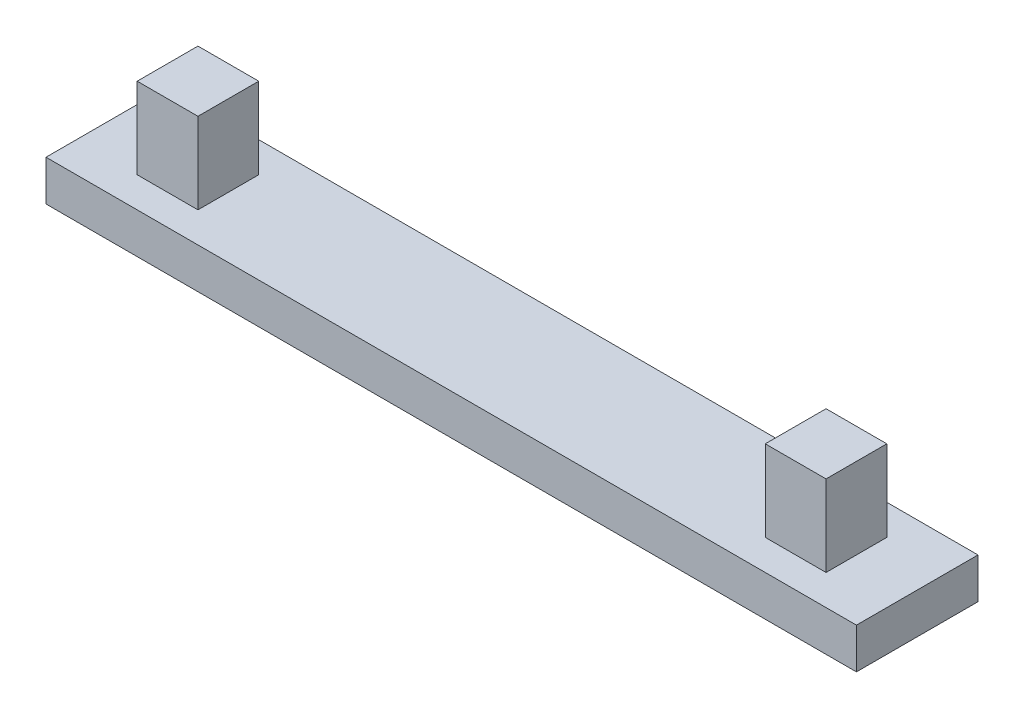
ISO-10303-21;
HEADER;
FILE_DESCRIPTION(('STEP AP214'),'2;1');
FILE_NAME('part.step','',(''),(''),'','','');
FILE_SCHEMA(('AUTOMOTIVE_DESIGN { 1 0 10303 214 1 1 1 1 }'));
ENDSEC;
DATA;
#1=APPLICATION_CONTEXT('core data for automotive mechanical design processes');
#2=APPLICATION_PROTOCOL_DEFINITION('international standard','automotive_design',2000,#1);
#3=PRODUCT_CONTEXT('',#1,'mechanical');
#4=PRODUCT('Part','Part','',(#3));
#5=PRODUCT_RELATED_PRODUCT_CATEGORY('part','',(#4));
#6=PRODUCT_DEFINITION_FORMATION('','',#4);
#7=PRODUCT_DEFINITION_CONTEXT('part definition',#1,'design');
#8=PRODUCT_DEFINITION('design','',#6,#7);
#9=PRODUCT_DEFINITION_SHAPE('','',#8);
#10=(LENGTH_UNIT() NAMED_UNIT(*) SI_UNIT(.MILLI.,.METRE.));
#11=(NAMED_UNIT(*) PLANE_ANGLE_UNIT() SI_UNIT($,.RADIAN.));
#12=(NAMED_UNIT(*) SI_UNIT($,.STERADIAN.) SOLID_ANGLE_UNIT());
#13=UNCERTAINTY_MEASURE_WITH_UNIT(LENGTH_MEASURE(1.E-05),#10,'distance_accuracy_value','');
#14=(GEOMETRIC_REPRESENTATION_CONTEXT(3) GLOBAL_UNCERTAINTY_ASSIGNED_CONTEXT((#13)) GLOBAL_UNIT_ASSIGNED_CONTEXT((#10,
#11,#12)) REPRESENTATION_CONTEXT('',''));
#15=CARTESIAN_POINT('',(0.,0.,0.));
#16=DIRECTION('',(0.,0.,1.));
#17=DIRECTION('',(1.,0.,0.));
#18=AXIS2_PLACEMENT_3D('',#15,#16,#17);
#19=CARTESIAN_POINT('',(0.,1.,0.));
#20=DIRECTION('',(0.,0.,-1.));
#21=DIRECTION('',(-1.,0.,0.));
#22=AXIS2_PLACEMENT_3D('',#19,#20,#21);
#23=PLANE('',#22);
#24=DIRECTION('',(1.,0.,0.));
#25=VECTOR('',#24,1.);
#26=CARTESIAN_POINT('',(0.,0.,0.));
#27=LINE('',#26,#25);
#28=CARTESIAN_POINT('',(0.,0.,0.));
#29=VERTEX_POINT('',#28);
#30=CARTESIAN_POINT('',(20.,0.,0.));
#31=VERTEX_POINT('',#30);
#32=EDGE_CURVE('E136',#29,#31,#27,.T.);
#33=ORIENTED_EDGE('',*,*,#32,.T.);
#34=DIRECTION('',(0.,-1.,0.));
#35=VECTOR('',#34,1.);
#36=CARTESIAN_POINT('',(20.,1.,0.));
#37=LINE('',#36,#35);
#38=CARTESIAN_POINT('',(20.,1.,0.));
#39=VERTEX_POINT('',#38);
#40=EDGE_CURVE('E11',#39,#31,#37,.T.);
#41=ORIENTED_EDGE('',*,*,#40,.F.);
#42=DIRECTION('',(1.,0.,0.));
#43=VECTOR('',#42,1.);
#44=CARTESIAN_POINT('',(0.,1.,0.));
#45=LINE('',#44,#43);
#46=CARTESIAN_POINT('',(0.,1.,0.));
#47=VERTEX_POINT('',#46);
#48=EDGE_CURVE('E101',#47,#39,#45,.T.);
#49=ORIENTED_EDGE('',*,*,#48,.F.);
#50=DIRECTION('',(0.,-1.,0.));
#51=VECTOR('',#50,1.);
#52=CARTESIAN_POINT('',(0.,1.,0.));
#53=LINE('',#52,#51);
#54=EDGE_CURVE('E78',#47,#29,#53,.T.);
#55=ORIENTED_EDGE('',*,*,#54,.T.);
#56=EDGE_LOOP('',(#33,#41,#49,#55));
#57=FACE_BOUND('',#56,.T.);
#58=ADVANCED_FACE('F35',(#57),#23,.F.);
#59=CARTESIAN_POINT('',(20.,1.,0.));
#60=DIRECTION('',(-1.,0.,0.));
#61=DIRECTION('',(0.,0.,1.));
#62=AXIS2_PLACEMENT_3D('',#59,#60,#61);
#63=PLANE('',#62);
#64=DIRECTION('',(0.,0.,-1.));
#65=VECTOR('',#64,1.);
#66=CARTESIAN_POINT('',(20.,0.,0.));
#67=LINE('',#66,#65);
#68=CARTESIAN_POINT('',(20.,0.,-3.));
#69=VERTEX_POINT('',#68);
#70=EDGE_CURVE('E138',#31,#69,#67,.T.);
#71=ORIENTED_EDGE('',*,*,#70,.T.);
#72=DIRECTION('',(0.,-1.,0.));
#73=VECTOR('',#72,1.);
#74=CARTESIAN_POINT('',(20.,1.,-3.));
#75=LINE('',#74,#73);
#76=CARTESIAN_POINT('',(20.,1.,-3.));
#77=VERTEX_POINT('',#76);
#78=EDGE_CURVE('E43',#77,#69,#75,.T.);
#79=ORIENTED_EDGE('',*,*,#78,.F.);
#80=DIRECTION('',(0.,0.,-1.));
#81=VECTOR('',#80,1.);
#82=CARTESIAN_POINT('',(20.,1.,0.));
#83=LINE('',#82,#81);
#84=EDGE_CURVE('E86',#39,#77,#83,.T.);
#85=ORIENTED_EDGE('',*,*,#84,.F.);
#86=ORIENTED_EDGE('',*,*,#40,.T.);
#87=EDGE_LOOP('',(#71,#79,#85,#86));
#88=FACE_BOUND('',#87,.T.);
#89=ADVANCED_FACE('F148',(#88),#63,.F.);
#90=CARTESIAN_POINT('',(0.,1.,-3.));
#91=DIRECTION('',(0.,0.,-1.));
#92=DIRECTION('',(-1.,0.,0.));
#93=AXIS2_PLACEMENT_3D('',#90,#91,#92);
#94=PLANE('',#93);
#95=DIRECTION('',(1.,0.,0.));
#96=VECTOR('',#95,1.);
#97=CARTESIAN_POINT('',(0.,0.,-3.));
#98=LINE('',#97,#96);
#99=CARTESIAN_POINT('',(0.,0.,-3.));
#100=VERTEX_POINT('',#99);
#101=EDGE_CURVE('E142',#100,#69,#98,.T.);
#102=ORIENTED_EDGE('',*,*,#101,.F.);
#103=DIRECTION('',(0.,-1.,0.));
#104=VECTOR('',#103,1.);
#105=CARTESIAN_POINT('',(0.,1.,-3.));
#106=LINE('',#105,#104);
#107=CARTESIAN_POINT('',(0.,1.,-3.));
#108=VERTEX_POINT('',#107);
#109=EDGE_CURVE('E70',#108,#100,#106,.T.);
#110=ORIENTED_EDGE('',*,*,#109,.F.);
#111=DIRECTION('',(1.,0.,0.));
#112=VECTOR('',#111,1.);
#113=CARTESIAN_POINT('',(0.,1.,-3.));
#114=LINE('',#113,#112);
#115=EDGE_CURVE('E108',#108,#77,#114,.T.);
#116=ORIENTED_EDGE('',*,*,#115,.T.);
#117=ORIENTED_EDGE('',*,*,#78,.T.);
#118=EDGE_LOOP('',(#102,#110,#116,#117));
#119=FACE_BOUND('',#118,.T.);
#120=ADVANCED_FACE('F147',(#119),#94,.T.);
#121=CARTESIAN_POINT('',(0.,1.,0.));
#122=DIRECTION('',(-1.,0.,0.));
#123=DIRECTION('',(0.,0.,1.));
#124=AXIS2_PLACEMENT_3D('',#121,#122,#123);
#125=PLANE('',#124);
#126=DIRECTION('',(0.,0.,-1.));
#127=VECTOR('',#126,1.);
#128=CARTESIAN_POINT('',(0.,0.,0.));
#129=LINE('',#128,#127);
#130=EDGE_CURVE('E97',#29,#100,#129,.T.);
#131=ORIENTED_EDGE('',*,*,#130,.F.);
#132=ORIENTED_EDGE('',*,*,#54,.F.);
#133=DIRECTION('',(0.,0.,-1.));
#134=VECTOR('',#133,1.);
#135=CARTESIAN_POINT('',(0.,1.,0.));
#136=LINE('',#135,#134);
#137=EDGE_CURVE('E95',#47,#108,#136,.T.);
#138=ORIENTED_EDGE('',*,*,#137,.T.);
#139=ORIENTED_EDGE('',*,*,#109,.T.);
#140=EDGE_LOOP('',(#131,#132,#138,#139));
#141=FACE_BOUND('',#140,.T.);
#142=ADVANCED_FACE('F93',(#141),#125,.T.);
#143=CARTESIAN_POINT('',(0.,1.,0.));
#144=DIRECTION('',(0.,1.,0.));
#145=DIRECTION('',(0.,0.,1.));
#146=AXIS2_PLACEMENT_3D('',#143,#144,#145);
#147=PLANE('',#146);
#148=ORIENTED_EDGE('',*,*,#48,.T.);
#149=ORIENTED_EDGE('',*,*,#84,.T.);
#150=ORIENTED_EDGE('',*,*,#115,.F.);
#151=ORIENTED_EDGE('',*,*,#137,.F.);
#152=EDGE_LOOP('',(#148,#149,#150,#151));
#153=FACE_BOUND('',#152,.T.);
#154=DIRECTION('',(1.,0.,0.));
#155=VECTOR('',#154,1.);
#156=CARTESIAN_POINT('',(0.,1.,-2.25));
#157=LINE('',#156,#155);
#158=CARTESIAN_POINT('',(1.5,1.,-2.25));
#159=VERTEX_POINT('',#158);
#160=CARTESIAN_POINT('',(3.,1.,-2.25));
#161=VERTEX_POINT('',#160);
#162=EDGE_CURVE('E109',#159,#161,#157,.T.);
#163=ORIENTED_EDGE('',*,*,#162,.T.);
#164=DIRECTION('',(0.,0.,1.));
#165=VECTOR('',#164,1.);
#166=CARTESIAN_POINT('',(3.,1.,0.));
#167=LINE('',#166,#165);
#168=CARTESIAN_POINT('',(3.,1.,-0.75));
#169=VERTEX_POINT('',#168);
#170=EDGE_CURVE('E112',#161,#169,#167,.T.);
#171=ORIENTED_EDGE('',*,*,#170,.T.);
#172=DIRECTION('',(1.,0.,0.));
#173=VECTOR('',#172,1.);
#174=CARTESIAN_POINT('',(0.,1.,-0.75));
#175=LINE('',#174,#173);
#176=CARTESIAN_POINT('',(1.5,1.,-0.75));
#177=VERTEX_POINT('',#176);
#178=EDGE_CURVE('E119',#177,#169,#175,.T.);
#179=ORIENTED_EDGE('',*,*,#178,.F.);
#180=DIRECTION('',(0.,0.,1.));
#181=VECTOR('',#180,1.);
#182=CARTESIAN_POINT('',(1.5,1.,0.));
#183=LINE('',#182,#181);
#184=EDGE_CURVE('E122',#159,#177,#183,.T.);
#185=ORIENTED_EDGE('',*,*,#184,.F.);
#186=EDGE_LOOP('',(#163,#171,#179,#185));
#187=FACE_BOUND('',#186,.T.);
#188=DIRECTION('',(1.,0.,0.));
#189=VECTOR('',#188,1.);
#190=CARTESIAN_POINT('',(0.,1.,-2.25));
#191=LINE('',#190,#189);
#192=CARTESIAN_POINT('',(17.,1.,-2.25));
#193=VERTEX_POINT('',#192);
#194=CARTESIAN_POINT('',(18.5,1.,-2.25));
#195=VERTEX_POINT('',#194);
#196=EDGE_CURVE('E125',#193,#195,#191,.T.);
#197=ORIENTED_EDGE('',*,*,#196,.T.);
#198=DIRECTION('',(0.,0.,1.));
#199=VECTOR('',#198,1.);
#200=CARTESIAN_POINT('',(18.5,1.,0.));
#201=LINE('',#200,#199);
#202=CARTESIAN_POINT('',(18.5,1.,-0.75));
#203=VERTEX_POINT('',#202);
#204=EDGE_CURVE('E128',#195,#203,#201,.T.);
#205=ORIENTED_EDGE('',*,*,#204,.T.);
#206=DIRECTION('',(1.,0.,0.));
#207=VECTOR('',#206,1.);
#208=CARTESIAN_POINT('',(0.,1.,-0.75));
#209=LINE('',#208,#207);
#210=CARTESIAN_POINT('',(17.,1.,-0.75));
#211=VERTEX_POINT('',#210);
#212=EDGE_CURVE('E131',#211,#203,#209,.T.);
#213=ORIENTED_EDGE('',*,*,#212,.F.);
#214=DIRECTION('',(0.,0.,1.));
#215=VECTOR('',#214,1.);
#216=CARTESIAN_POINT('',(17.,1.,0.));
#217=LINE('',#216,#215);
#218=EDGE_CURVE('E98',#193,#211,#217,.T.);
#219=ORIENTED_EDGE('',*,*,#218,.F.);
#220=EDGE_LOOP('',(#197,#205,#213,#219));
#221=FACE_BOUND('',#220,.T.);
#222=ADVANCED_FACE('F105',(#153,#187,#221),#147,.T.);
#223=CARTESIAN_POINT('',(0.,0.,0.));
#224=DIRECTION('',(0.,1.,0.));
#225=DIRECTION('',(0.,0.,1.));
#226=AXIS2_PLACEMENT_3D('',#223,#224,#225);
#227=PLANE('',#226);
#228=ORIENTED_EDGE('',*,*,#32,.F.);
#229=ORIENTED_EDGE('',*,*,#130,.T.);
#230=ORIENTED_EDGE('',*,*,#101,.T.);
#231=ORIENTED_EDGE('',*,*,#70,.F.);
#232=EDGE_LOOP('',(#228,#229,#230,#231));
#233=FACE_BOUND('',#232,.T.);
#234=ADVANCED_FACE('F150',(#233),#227,.F.);
#235=CARTESIAN_POINT('',(1.5,3.,-2.25));
#236=DIRECTION('',(1.,0.,0.));
#237=DIRECTION('',(0.,0.,-1.));
#238=AXIS2_PLACEMENT_3D('',#235,#236,#237);
#239=PLANE('',#238);
#240=ORIENTED_EDGE('',*,*,#184,.T.);
#241=DIRECTION('',(0.,-1.,0.));
#242=VECTOR('',#241,1.);
#243=CARTESIAN_POINT('',(1.5,3.,-0.75));
#244=LINE('',#243,#242);
#245=CARTESIAN_POINT('',(1.5,3.,-0.75));
#246=VERTEX_POINT('',#245);
#247=EDGE_CURVE('E139',#246,#177,#244,.T.);
#248=ORIENTED_EDGE('',*,*,#247,.F.);
#249=DIRECTION('',(0.,0.,1.));
#250=VECTOR('',#249,1.);
#251=CARTESIAN_POINT('',(1.5,3.,-2.25));
#252=LINE('',#251,#250);
#253=CARTESIAN_POINT('',(1.5,3.,-2.25));
#254=VERTEX_POINT('',#253);
#255=EDGE_CURVE('E301',#254,#246,#252,.T.);
#256=ORIENTED_EDGE('',*,*,#255,.F.);
#257=DIRECTION('',(0.,-1.,0.));
#258=VECTOR('',#257,1.);
#259=CARTESIAN_POINT('',(1.5,3.,-2.25));
#260=LINE('',#259,#258);
#261=EDGE_CURVE('E332',#254,#159,#260,.T.);
#262=ORIENTED_EDGE('',*,*,#261,.T.);
#263=EDGE_LOOP('',(#240,#248,#256,#262));
#264=FACE_BOUND('',#263,.T.);
#265=ADVANCED_FACE('F152',(#264),#239,.F.);
#266=CARTESIAN_POINT('',(1.5,3.,-0.75));
#267=DIRECTION('',(0.,0.,-1.));
#268=DIRECTION('',(-1.,0.,0.));
#269=AXIS2_PLACEMENT_3D('',#266,#267,#268);
#270=PLANE('',#269);
#271=ORIENTED_EDGE('',*,*,#178,.T.);
#272=DIRECTION('',(0.,-1.,0.));
#273=VECTOR('',#272,1.);
#274=CARTESIAN_POINT('',(3.,3.,-0.75));
#275=LINE('',#274,#273);
#276=CARTESIAN_POINT('',(3.,3.,-0.75));
#277=VERTEX_POINT('',#276);
#278=EDGE_CURVE('E337',#277,#169,#275,.T.);
#279=ORIENTED_EDGE('',*,*,#278,.F.);
#280=DIRECTION('',(1.,0.,0.));
#281=VECTOR('',#280,1.);
#282=CARTESIAN_POINT('',(1.5,3.,-0.75));
#283=LINE('',#282,#281);
#284=EDGE_CURVE('E323',#246,#277,#283,.T.);
#285=ORIENTED_EDGE('',*,*,#284,.F.);
#286=ORIENTED_EDGE('',*,*,#247,.T.);
#287=EDGE_LOOP('',(#271,#279,#285,#286));
#288=FACE_BOUND('',#287,.T.);
#289=ADVANCED_FACE('F158',(#288),#270,.F.);
#290=CARTESIAN_POINT('',(3.,3.,-2.25));
#291=DIRECTION('',(1.,0.,0.));
#292=DIRECTION('',(0.,0.,-1.));
#293=AXIS2_PLACEMENT_3D('',#290,#291,#292);
#294=PLANE('',#293);
#295=ORIENTED_EDGE('',*,*,#278,.T.);
#296=ORIENTED_EDGE('',*,*,#170,.F.);
#297=DIRECTION('',(0.,-1.,0.));
#298=VECTOR('',#297,1.);
#299=CARTESIAN_POINT('',(3.,3.,-2.25));
#300=LINE('',#299,#298);
#301=CARTESIAN_POINT('',(3.,3.,-2.25));
#302=VERTEX_POINT('',#301);
#303=EDGE_CURVE('E335',#302,#161,#300,.T.);
#304=ORIENTED_EDGE('',*,*,#303,.F.);
#305=DIRECTION('',(0.,0.,1.));
#306=VECTOR('',#305,1.);
#307=CARTESIAN_POINT('',(3.,3.,-2.25));
#308=LINE('',#307,#306);
#309=EDGE_CURVE('E326',#302,#277,#308,.T.);
#310=ORIENTED_EDGE('',*,*,#309,.T.);
#311=EDGE_LOOP('',(#295,#296,#304,#310));
#312=FACE_BOUND('',#311,.T.);
#313=ADVANCED_FACE('F201',(#312),#294,.T.);
#314=CARTESIAN_POINT('',(1.5,3.,-2.25));
#315=DIRECTION('',(0.,0.,-1.));
#316=DIRECTION('',(-1.,0.,0.));
#317=AXIS2_PLACEMENT_3D('',#314,#315,#316);
#318=PLANE('',#317);
#319=ORIENTED_EDGE('',*,*,#303,.T.);
#320=ORIENTED_EDGE('',*,*,#162,.F.);
#321=ORIENTED_EDGE('',*,*,#261,.F.);
#322=DIRECTION('',(1.,0.,0.));
#323=VECTOR('',#322,1.);
#324=CARTESIAN_POINT('',(1.5,3.,-2.25));
#325=LINE('',#324,#323);
#326=EDGE_CURVE('E329',#254,#302,#325,.T.);
#327=ORIENTED_EDGE('',*,*,#326,.T.);
#328=EDGE_LOOP('',(#319,#320,#321,#327));
#329=FACE_BOUND('',#328,.T.);
#330=ADVANCED_FACE('F211',(#329),#318,.T.);
#331=CARTESIAN_POINT('',(0.,3.,0.));
#332=DIRECTION('',(0.,1.,0.));
#333=DIRECTION('',(0.,0.,1.));
#334=AXIS2_PLACEMENT_3D('',#331,#332,#333);
#335=PLANE('',#334);
#336=ORIENTED_EDGE('',*,*,#255,.T.);
#337=ORIENTED_EDGE('',*,*,#284,.T.);
#338=ORIENTED_EDGE('',*,*,#309,.F.);
#339=ORIENTED_EDGE('',*,*,#326,.F.);
#340=EDGE_LOOP('',(#336,#337,#338,#339));
#341=FACE_BOUND('',#340,.T.);
#342=ADVANCED_FACE('F221',(#341),#335,.T.);
#343=CARTESIAN_POINT('',(17.,3.,-2.25));
#344=DIRECTION('',(1.,0.,0.));
#345=DIRECTION('',(0.,0.,-1.));
#346=AXIS2_PLACEMENT_3D('',#343,#344,#345);
#347=PLANE('',#346);
#348=ORIENTED_EDGE('',*,*,#218,.T.);
#349=DIRECTION('',(0.,-1.,0.));
#350=VECTOR('',#349,1.);
#351=CARTESIAN_POINT('',(17.,3.,-0.75));
#352=LINE('',#351,#350);
#353=CARTESIAN_POINT('',(17.,3.,-0.75));
#354=VERTEX_POINT('',#353);
#355=EDGE_CURVE('E304',#354,#211,#352,.T.);
#356=ORIENTED_EDGE('',*,*,#355,.F.);
#357=DIRECTION('',(0.,0.,1.));
#358=VECTOR('',#357,1.);
#359=CARTESIAN_POINT('',(17.,3.,-2.25));
#360=LINE('',#359,#358);
#361=CARTESIAN_POINT('',(17.,3.,-2.25));
#362=VERTEX_POINT('',#361);
#363=EDGE_CURVE('E289',#362,#354,#360,.T.);
#364=ORIENTED_EDGE('',*,*,#363,.F.);
#365=DIRECTION('',(0.,-1.,0.));
#366=VECTOR('',#365,1.);
#367=CARTESIAN_POINT('',(17.,3.,-2.25));
#368=LINE('',#367,#366);
#369=EDGE_CURVE('E314',#362,#193,#368,.T.);
#370=ORIENTED_EDGE('',*,*,#369,.T.);
#371=EDGE_LOOP('',(#348,#356,#364,#370));
#372=FACE_BOUND('',#371,.T.);
#373=ADVANCED_FACE('F231',(#372),#347,.F.);
#374=CARTESIAN_POINT('',(17.,3.,-0.75));
#375=DIRECTION('',(0.,0.,-1.));
#376=DIRECTION('',(-1.,0.,0.));
#377=AXIS2_PLACEMENT_3D('',#374,#375,#376);
#378=PLANE('',#377);
#379=ORIENTED_EDGE('',*,*,#212,.T.);
#380=DIRECTION('',(0.,-1.,0.));
#381=VECTOR('',#380,1.);
#382=CARTESIAN_POINT('',(18.5,3.,-0.75));
#383=LINE('',#382,#381);
#384=CARTESIAN_POINT('',(18.5,3.,-0.75));
#385=VERTEX_POINT('',#384);
#386=EDGE_CURVE('E308',#385,#203,#383,.T.);
#387=ORIENTED_EDGE('',*,*,#386,.F.);
#388=DIRECTION('',(1.,0.,0.));
#389=VECTOR('',#388,1.);
#390=CARTESIAN_POINT('',(17.,3.,-0.75));
#391=LINE('',#390,#389);
#392=EDGE_CURVE('E294',#354,#385,#391,.T.);
#393=ORIENTED_EDGE('',*,*,#392,.F.);
#394=ORIENTED_EDGE('',*,*,#355,.T.);
#395=EDGE_LOOP('',(#379,#387,#393,#394));
#396=FACE_BOUND('',#395,.T.);
#397=ADVANCED_FACE('F241',(#396),#378,.F.);
#398=CARTESIAN_POINT('',(18.5,3.,-2.25));
#399=DIRECTION('',(1.,0.,0.));
#400=DIRECTION('',(0.,0.,-1.));
#401=AXIS2_PLACEMENT_3D('',#398,#399,#400);
#402=PLANE('',#401);
#403=ORIENTED_EDGE('',*,*,#386,.T.);
#404=ORIENTED_EDGE('',*,*,#204,.F.);
#405=DIRECTION('',(0.,-1.,0.));
#406=VECTOR('',#405,1.);
#407=CARTESIAN_POINT('',(18.5,3.,-2.25));
#408=LINE('',#407,#406);
#409=CARTESIAN_POINT('',(18.5,3.,-2.25));
#410=VERTEX_POINT('',#409);
#411=EDGE_CURVE('E51',#410,#195,#408,.T.);
#412=ORIENTED_EDGE('',*,*,#411,.F.);
#413=DIRECTION('',(0.,0.,1.));
#414=VECTOR('',#413,1.);
#415=CARTESIAN_POINT('',(18.5,3.,-2.25));
#416=LINE('',#415,#414);
#417=EDGE_CURVE('E317',#410,#385,#416,.T.);
#418=ORIENTED_EDGE('',*,*,#417,.T.);
#419=EDGE_LOOP('',(#403,#404,#412,#418));
#420=FACE_BOUND('',#419,.T.);
#421=ADVANCED_FACE('F251',(#420),#402,.T.);
#422=CARTESIAN_POINT('',(17.,3.,-2.25));
#423=DIRECTION('',(0.,0.,-1.));
#424=DIRECTION('',(-1.,0.,0.));
#425=AXIS2_PLACEMENT_3D('',#422,#423,#424);
#426=PLANE('',#425);
#427=ORIENTED_EDGE('',*,*,#411,.T.);
#428=ORIENTED_EDGE('',*,*,#196,.F.);
#429=ORIENTED_EDGE('',*,*,#369,.F.);
#430=DIRECTION('',(1.,0.,0.));
#431=VECTOR('',#430,1.);
#432=CARTESIAN_POINT('',(17.,3.,-2.25));
#433=LINE('',#432,#431);
#434=EDGE_CURVE('E297',#362,#410,#433,.T.);
#435=ORIENTED_EDGE('',*,*,#434,.T.);
#436=EDGE_LOOP('',(#427,#428,#429,#435));
#437=FACE_BOUND('',#436,.T.);
#438=ADVANCED_FACE('F261',(#437),#426,.T.);
#439=CARTESIAN_POINT('',(0.,3.,0.));
#440=DIRECTION('',(0.,1.,0.));
#441=DIRECTION('',(0.,0.,1.));
#442=AXIS2_PLACEMENT_3D('',#439,#440,#441);
#443=PLANE('',#442);
#444=ORIENTED_EDGE('',*,*,#363,.T.);
#445=ORIENTED_EDGE('',*,*,#392,.T.);
#446=ORIENTED_EDGE('',*,*,#417,.F.);
#447=ORIENTED_EDGE('',*,*,#434,.F.);
#448=EDGE_LOOP('',(#444,#445,#446,#447));
#449=FACE_BOUND('',#448,.T.);
#450=ADVANCED_FACE('F271',(#449),#443,.T.);
#451=CLOSED_SHELL('',(#58,#89,#120,#142,#222,#234,#265,#289,#313,#330,#342,#373,#397,#421,#438,#450));
#452=MANIFOLD_SOLID_BREP('B2',#451);
#453=ADVANCED_BREP_SHAPE_REPRESENTATION('',(#18,#452),#14);
#454=SHAPE_DEFINITION_REPRESENTATION(#9,#453);
ENDSEC;
END-ISO-10303-21;
